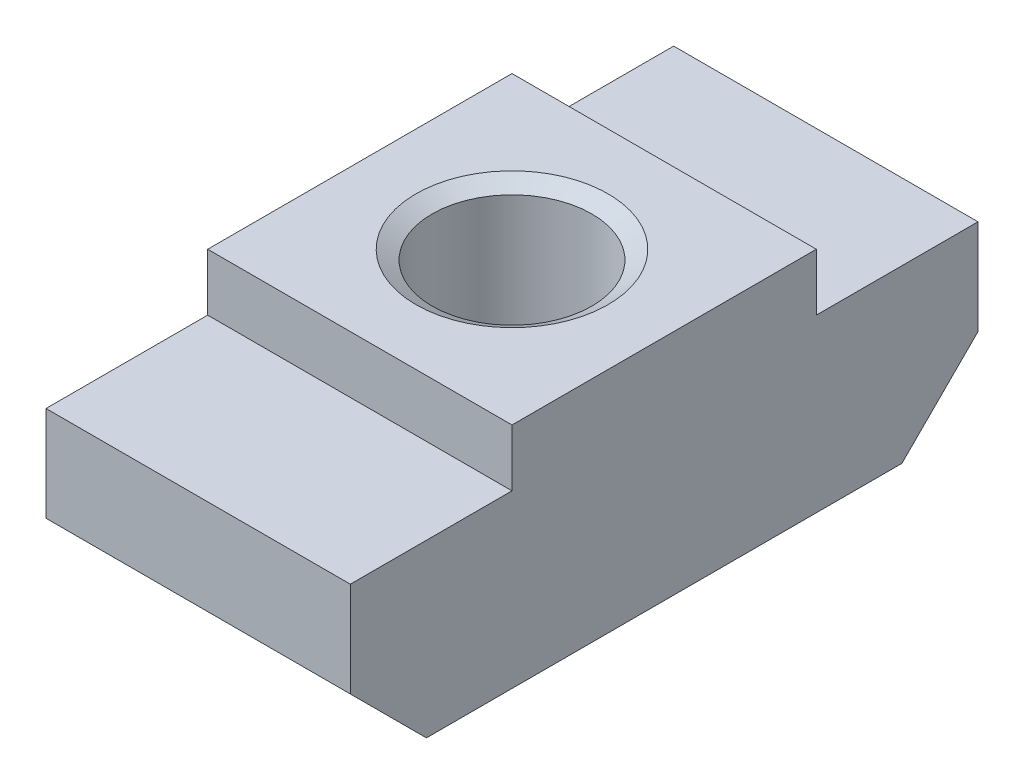
ISO-10303-21;
HEADER;
FILE_DESCRIPTION(('STEP AP214'),'2;1');
FILE_NAME('part.step','',(''),(''),'','','');
FILE_SCHEMA(('AUTOMOTIVE_DESIGN { 1 0 10303 214 1 1 1 1 }'));
ENDSEC;
DATA;
#1=APPLICATION_CONTEXT('core data for automotive mechanical design processes');
#2=APPLICATION_PROTOCOL_DEFINITION('international standard','automotive_design',2000,#1);
#3=PRODUCT_CONTEXT('',#1,'mechanical');
#4=PRODUCT('Part','Part','',(#3));
#5=PRODUCT_RELATED_PRODUCT_CATEGORY('part','',(#4));
#6=PRODUCT_DEFINITION_FORMATION('','',#4);
#7=PRODUCT_DEFINITION_CONTEXT('part definition',#1,'design');
#8=PRODUCT_DEFINITION('design','',#6,#7);
#9=PRODUCT_DEFINITION_SHAPE('','',#8);
#10=(LENGTH_UNIT() NAMED_UNIT(*) SI_UNIT(.MILLI.,.METRE.));
#11=(NAMED_UNIT(*) PLANE_ANGLE_UNIT() SI_UNIT($,.RADIAN.));
#12=(NAMED_UNIT(*) SI_UNIT($,.STERADIAN.) SOLID_ANGLE_UNIT());
#13=UNCERTAINTY_MEASURE_WITH_UNIT(LENGTH_MEASURE(1.E-05),#10,'distance_accuracy_value','');
#14=(GEOMETRIC_REPRESENTATION_CONTEXT(3) GLOBAL_UNCERTAINTY_ASSIGNED_CONTEXT((#13)) GLOBAL_UNIT_ASSIGNED_CONTEXT((#10,
#11,#12)) REPRESENTATION_CONTEXT('',''));
#15=CARTESIAN_POINT('',(0.,0.,0.));
#16=DIRECTION('',(0.,0.,1.));
#17=DIRECTION('',(1.,0.,0.));
#18=AXIS2_PLACEMENT_3D('',#15,#16,#17);
#19=CARTESIAN_POINT('',(-4.,6.,16.5));
#20=DIRECTION('',(1.,0.,0.));
#21=DIRECTION('',(0.,0.,-1.));
#22=AXIS2_PLACEMENT_3D('',#19,#20,#21);
#23=PLANE('',#22);
#24=DIRECTION('',(0.,0.,-1.));
#25=VECTOR('',#24,1.);
#26=CARTESIAN_POINT('',(-4.,4.5,16.5));
#27=LINE('',#26,#25);
#28=CARTESIAN_POINT('',(-4.,4.5,16.5));
#29=VERTEX_POINT('',#28);
#30=CARTESIAN_POINT('',(-4.,4.5,12.25));
#31=VERTEX_POINT('',#30);
#32=EDGE_CURVE('E49',#29,#31,#27,.T.);
#33=ORIENTED_EDGE('',*,*,#32,.T.);
#34=DIRECTION('',(0.,1.,0.));
#35=VECTOR('',#34,1.);
#36=CARTESIAN_POINT('',(-4.,6.,12.25));
#37=LINE('',#36,#35);
#38=CARTESIAN_POINT('',(-4.,6.,12.25));
#39=VERTEX_POINT('',#38);
#40=EDGE_CURVE('E220',#31,#39,#37,.T.);
#41=ORIENTED_EDGE('',*,*,#40,.T.);
#42=DIRECTION('',(0.,0.,-1.));
#43=VECTOR('',#42,1.);
#44=CARTESIAN_POINT('',(-4.,6.,16.5));
#45=LINE('',#44,#43);
#46=CARTESIAN_POINT('',(-4.,6.,4.25));
#47=VERTEX_POINT('',#46);
#48=EDGE_CURVE('E129',#39,#47,#45,.T.);
#49=ORIENTED_EDGE('',*,*,#48,.T.);
#50=DIRECTION('',(0.,-1.,0.));
#51=VECTOR('',#50,1.);
#52=CARTESIAN_POINT('',(-4.,6.,4.25));
#53=LINE('',#52,#51);
#54=CARTESIAN_POINT('',(-4.,4.5,4.25));
#55=VERTEX_POINT('',#54);
#56=EDGE_CURVE('E165',#47,#55,#53,.T.);
#57=ORIENTED_EDGE('',*,*,#56,.T.);
#58=DIRECTION('',(0.,0.,-1.));
#59=VECTOR('',#58,1.);
#60=CARTESIAN_POINT('',(-4.,4.5,16.5));
#61=LINE('',#60,#59);
#62=CARTESIAN_POINT('',(-4.,4.5,0.));
#63=VERTEX_POINT('',#62);
#64=EDGE_CURVE('E170',#55,#63,#61,.T.);
#65=ORIENTED_EDGE('',*,*,#64,.T.);
#66=DIRECTION('',(0.,-1.,0.));
#67=VECTOR('',#66,1.);
#68=CARTESIAN_POINT('',(-4.,6.,0.));
#69=LINE('',#68,#67);
#70=CARTESIAN_POINT('',(-4.,2.,0.));
#71=VERTEX_POINT('',#70);
#72=EDGE_CURVE('E138',#63,#71,#69,.T.);
#73=ORIENTED_EDGE('',*,*,#72,.T.);
#74=DIRECTION('',(0.,-0.707106781186548,0.707106781186548));
#75=VECTOR('',#74,1.);
#76=CARTESIAN_POINT('',(-4.,-4.25,6.25));
#77=LINE('',#76,#75);
#78=CARTESIAN_POINT('',(-4.,0.,2.));
#79=VERTEX_POINT('',#78);
#80=EDGE_CURVE('E167',#71,#79,#77,.T.);
#81=ORIENTED_EDGE('',*,*,#80,.T.);
#82=DIRECTION('',(0.,0.,-1.));
#83=VECTOR('',#82,1.);
#84=CARTESIAN_POINT('',(-4.,0.,16.5));
#85=LINE('',#84,#83);
#86=CARTESIAN_POINT('',(-4.,0.,14.5));
#87=VERTEX_POINT('',#86);
#88=EDGE_CURVE('E147',#87,#79,#85,.T.);
#89=ORIENTED_EDGE('',*,*,#88,.F.);
#90=DIRECTION('',(0.,0.707106781186547,0.707106781186548));
#91=VECTOR('',#90,1.);
#92=CARTESIAN_POINT('',(-4.,4.,18.5));
#93=LINE('',#92,#91);
#94=CARTESIAN_POINT('',(-4.,2.,16.5));
#95=VERTEX_POINT('',#94);
#96=EDGE_CURVE('E180',#87,#95,#93,.T.);
#97=ORIENTED_EDGE('',*,*,#96,.T.);
#98=DIRECTION('',(0.,-1.,0.));
#99=VECTOR('',#98,1.);
#100=CARTESIAN_POINT('',(-4.,6.,16.5));
#101=LINE('',#100,#99);
#102=EDGE_CURVE('E130',#29,#95,#101,.T.);
#103=ORIENTED_EDGE('',*,*,#102,.F.);
#104=EDGE_LOOP('',(#33,#41,#49,#57,#65,#73,#81,#89,#97,#103));
#105=FACE_BOUND('',#104,.T.);
#106=ADVANCED_FACE('F36',(#105),#23,.F.);
#107=CARTESIAN_POINT('',(-4.,0.,16.5));
#108=DIRECTION('',(0.,1.,0.));
#109=DIRECTION('',(0.,0.,1.));
#110=AXIS2_PLACEMENT_3D('',#107,#108,#109);
#111=PLANE('',#110);
#112=CARTESIAN_POINT('',(0.,0.,8.25));
#113=DIRECTION('',(0.,1.,0.));
#114=DIRECTION('',(0.,0.,1.));
#115=AXIS2_PLACEMENT_3D('',#112,#113,#114);
#116=CIRCLE('',#115,2.1);
#117=CARTESIAN_POINT('',(0.,0.,10.35));
#118=VERTEX_POINT('',#117);
#119=EDGE_CURVE('E140',#118,#118,#116,.T.);
#120=ORIENTED_EDGE('',*,*,#119,.T.);
#121=EDGE_LOOP('',(#120));
#122=FACE_BOUND('',#121,.T.);
#123=ORIENTED_EDGE('',*,*,#88,.T.);
#124=DIRECTION('',(1.,0.,0.));
#125=VECTOR('',#124,1.);
#126=CARTESIAN_POINT('',(-6.,0.,2.));
#127=LINE('',#126,#125);
#128=CARTESIAN_POINT('',(4.,0.,2.));
#129=VERTEX_POINT('',#128);
#130=EDGE_CURVE('E164',#79,#129,#127,.T.);
#131=ORIENTED_EDGE('',*,*,#130,.T.);
#132=DIRECTION('',(0.,0.,-1.));
#133=VECTOR('',#132,1.);
#134=CARTESIAN_POINT('',(4.,0.,16.5));
#135=LINE('',#134,#133);
#136=CARTESIAN_POINT('',(4.,0.,14.5));
#137=VERTEX_POINT('',#136);
#138=EDGE_CURVE('E144',#137,#129,#135,.T.);
#139=ORIENTED_EDGE('',*,*,#138,.F.);
#140=DIRECTION('',(1.,0.,0.));
#141=VECTOR('',#140,1.);
#142=CARTESIAN_POINT('',(-6.,0.,14.5));
#143=LINE('',#142,#141);
#144=EDGE_CURVE('E178',#87,#137,#143,.T.);
#145=ORIENTED_EDGE('',*,*,#144,.F.);
#146=EDGE_LOOP('',(#123,#131,#139,#145));
#147=FACE_BOUND('',#146,.T.);
#148=ADVANCED_FACE('F191',(#122,#147),#111,.F.);
#149=CARTESIAN_POINT('',(4.,6.,16.5));
#150=DIRECTION('',(-1.,0.,0.));
#151=DIRECTION('',(0.,0.,1.));
#152=AXIS2_PLACEMENT_3D('',#149,#150,#151);
#153=PLANE('',#152);
#154=DIRECTION('',(0.,0.,-1.));
#155=VECTOR('',#154,1.);
#156=CARTESIAN_POINT('',(4.,6.,16.5));
#157=LINE('',#156,#155);
#158=CARTESIAN_POINT('',(4.,6.,12.25));
#159=VERTEX_POINT('',#158);
#160=CARTESIAN_POINT('',(4.,6.,4.25));
#161=VERTEX_POINT('',#160);
#162=EDGE_CURVE('E132',#159,#161,#157,.T.);
#163=ORIENTED_EDGE('',*,*,#162,.F.);
#164=DIRECTION('',(0.,1.,0.));
#165=VECTOR('',#164,1.);
#166=CARTESIAN_POINT('',(4.,4.5,12.25));
#167=LINE('',#166,#165);
#168=CARTESIAN_POINT('',(4.,4.5,12.25));
#169=VERTEX_POINT('',#168);
#170=EDGE_CURVE('E123',#169,#159,#167,.T.);
#171=ORIENTED_EDGE('',*,*,#170,.F.);
#172=DIRECTION('',(0.,0.,-1.));
#173=VECTOR('',#172,1.);
#174=CARTESIAN_POINT('',(4.,4.5,16.5));
#175=LINE('',#174,#173);
#176=CARTESIAN_POINT('',(4.,4.5,16.5));
#177=VERTEX_POINT('',#176);
#178=EDGE_CURVE('E112',#177,#169,#175,.T.);
#179=ORIENTED_EDGE('',*,*,#178,.F.);
#180=DIRECTION('',(0.,1.,0.));
#181=VECTOR('',#180,1.);
#182=CARTESIAN_POINT('',(4.,6.,16.5));
#183=LINE('',#182,#181);
#184=CARTESIAN_POINT('',(4.,2.,16.5));
#185=VERTEX_POINT('',#184);
#186=EDGE_CURVE('E122',#185,#177,#183,.T.);
#187=ORIENTED_EDGE('',*,*,#186,.F.);
#188=DIRECTION('',(0.,0.707106781186547,0.707106781186548));
#189=VECTOR('',#188,1.);
#190=CARTESIAN_POINT('',(4.,2.,16.5));
#191=LINE('',#190,#189);
#192=EDGE_CURVE('E176',#137,#185,#191,.T.);
#193=ORIENTED_EDGE('',*,*,#192,.F.);
#194=ORIENTED_EDGE('',*,*,#138,.T.);
#195=DIRECTION('',(0.,-0.707106781186548,0.707106781186548));
#196=VECTOR('',#195,1.);
#197=CARTESIAN_POINT('',(4.,2.,0.));
#198=LINE('',#197,#196);
#199=CARTESIAN_POINT('',(4.,2.,0.));
#200=VERTEX_POINT('',#199);
#201=EDGE_CURVE('E160',#200,#129,#198,.T.);
#202=ORIENTED_EDGE('',*,*,#201,.F.);
#203=DIRECTION('',(0.,1.,0.));
#204=VECTOR('',#203,1.);
#205=CARTESIAN_POINT('',(4.,6.,0.));
#206=LINE('',#205,#204);
#207=CARTESIAN_POINT('',(4.,4.5,0.));
#208=VERTEX_POINT('',#207);
#209=EDGE_CURVE('E134',#200,#208,#206,.T.);
#210=ORIENTED_EDGE('',*,*,#209,.T.);
#211=DIRECTION('',(0.,0.,-1.));
#212=VECTOR('',#211,1.);
#213=CARTESIAN_POINT('',(4.,4.5,0.));
#214=LINE('',#213,#212);
#215=CARTESIAN_POINT('',(4.,4.5,4.25));
#216=VERTEX_POINT('',#215);
#217=EDGE_CURVE('E57',#216,#208,#214,.T.);
#218=ORIENTED_EDGE('',*,*,#217,.F.);
#219=DIRECTION('',(0.,-1.,0.));
#220=VECTOR('',#219,1.);
#221=CARTESIAN_POINT('',(4.,4.5,4.25));
#222=LINE('',#221,#220);
#223=EDGE_CURVE('E226',#161,#216,#222,.T.);
#224=ORIENTED_EDGE('',*,*,#223,.F.);
#225=EDGE_LOOP('',(#163,#171,#179,#187,#193,#194,#202,#210,#218,#224));
#226=FACE_BOUND('',#225,.T.);
#227=ADVANCED_FACE('F120',(#226),#153,.F.);
#228=CARTESIAN_POINT('',(-4.,6.,16.5));
#229=DIRECTION('',(0.,-1.,0.));
#230=DIRECTION('',(0.,0.,-1.));
#231=AXIS2_PLACEMENT_3D('',#228,#229,#230);
#232=PLANE('',#231);
#233=CARTESIAN_POINT('',(0.,6.,8.25));
#234=DIRECTION('',(0.,1.,0.));
#235=DIRECTION('',(0.,0.,1.));
#236=AXIS2_PLACEMENT_3D('',#233,#234,#235);
#237=CIRCLE('',#236,2.525);
#238=CARTESIAN_POINT('',(0.,6.,10.775));
#239=VERTEX_POINT('',#238);
#240=EDGE_CURVE('E183',#239,#239,#237,.T.);
#241=ORIENTED_EDGE('',*,*,#240,.F.);
#242=EDGE_LOOP('',(#241));
#243=FACE_BOUND('',#242,.T.);
#244=ORIENTED_EDGE('',*,*,#48,.F.);
#245=DIRECTION('',(1.,0.,0.));
#246=VECTOR('',#245,1.);
#247=CARTESIAN_POINT('',(-6.,6.,12.25));
#248=LINE('',#247,#246);
#249=EDGE_CURVE('E214',#39,#159,#248,.T.);
#250=ORIENTED_EDGE('',*,*,#249,.T.);
#251=ORIENTED_EDGE('',*,*,#162,.T.);
#252=DIRECTION('',(1.,0.,0.));
#253=VECTOR('',#252,1.);
#254=CARTESIAN_POINT('',(-6.,6.,4.25));
#255=LINE('',#254,#253);
#256=EDGE_CURVE('E216',#47,#161,#255,.T.);
#257=ORIENTED_EDGE('',*,*,#256,.F.);
#258=EDGE_LOOP('',(#244,#250,#251,#257));
#259=FACE_BOUND('',#258,.T.);
#260=ADVANCED_FACE('F207',(#243,#259),#232,.F.);
#261=CARTESIAN_POINT('',(0.,0.,16.5));
#262=DIRECTION('',(0.,0.,1.));
#263=DIRECTION('',(1.,0.,0.));
#264=AXIS2_PLACEMENT_3D('',#261,#262,#263);
#265=PLANE('',#264);
#266=DIRECTION('',(1.,0.,0.));
#267=VECTOR('',#266,1.);
#268=CARTESIAN_POINT('',(0.,4.5,16.5));
#269=LINE('',#268,#267);
#270=EDGE_CURVE('E11',#29,#177,#269,.T.);
#271=ORIENTED_EDGE('',*,*,#270,.F.);
#272=ORIENTED_EDGE('',*,*,#102,.T.);
#273=DIRECTION('',(-1.,0.,0.));
#274=VECTOR('',#273,1.);
#275=CARTESIAN_POINT('',(0.,2.,16.5));
#276=LINE('',#275,#274);
#277=EDGE_CURVE('E128',#185,#95,#276,.T.);
#278=ORIENTED_EDGE('',*,*,#277,.F.);
#279=ORIENTED_EDGE('',*,*,#186,.T.);
#280=EDGE_LOOP('',(#271,#272,#278,#279));
#281=FACE_BOUND('',#280,.T.);
#282=ADVANCED_FACE('F126',(#281),#265,.T.);
#283=CARTESIAN_POINT('',(0.,0.,0.));
#284=DIRECTION('',(0.,0.,1.));
#285=DIRECTION('',(1.,0.,0.));
#286=AXIS2_PLACEMENT_3D('',#283,#284,#285);
#287=PLANE('',#286);
#288=ORIENTED_EDGE('',*,*,#72,.F.);
#289=DIRECTION('',(1.,0.,0.));
#290=VECTOR('',#289,1.);
#291=CARTESIAN_POINT('',(0.,4.5,0.));
#292=LINE('',#291,#290);
#293=EDGE_CURVE('E43',#63,#208,#292,.T.);
#294=ORIENTED_EDGE('',*,*,#293,.T.);
#295=ORIENTED_EDGE('',*,*,#209,.F.);
#296=DIRECTION('',(-1.,0.,0.));
#297=VECTOR('',#296,1.);
#298=CARTESIAN_POINT('',(0.,2.,0.));
#299=LINE('',#298,#297);
#300=EDGE_CURVE('E151',#200,#71,#299,.T.);
#301=ORIENTED_EDGE('',*,*,#300,.T.);
#302=EDGE_LOOP('',(#288,#294,#295,#301));
#303=FACE_BOUND('',#302,.T.);
#304=ADVANCED_FACE('F156',(#303),#287,.F.);
#305=CARTESIAN_POINT('',(0.,6.,8.25));
#306=DIRECTION('',(0.,1.,0.));
#307=DIRECTION('',(0.,0.,1.));
#308=AXIS2_PLACEMENT_3D('',#305,#306,#307);
#309=CYLINDRICAL_SURFACE('',#308,2.1);
#310=ORIENTED_EDGE('',*,*,#119,.F.);
#311=EDGE_LOOP('',(#310));
#312=FACE_BOUND('',#311,.T.);
#313=CARTESIAN_POINT('',(0.,5.75462613559441,8.25));
#314=DIRECTION('',(0.,1.,0.));
#315=DIRECTION('',(0.,0.,1.));
#316=AXIS2_PLACEMENT_3D('',#313,#314,#315);
#317=CIRCLE('',#316,2.1);
#318=CARTESIAN_POINT('',(0.,5.75462613559441,10.35));
#319=VERTEX_POINT('',#318);
#320=EDGE_CURVE('E186',#319,#319,#317,.T.);
#321=ORIENTED_EDGE('',*,*,#320,.T.);
#322=EDGE_LOOP('',(#321));
#323=FACE_BOUND('',#322,.T.);
#324=ADVANCED_FACE('F194',(#312,#323),#309,.F.);
#325=CARTESIAN_POINT('',(0.,6.,8.25));
#326=DIRECTION('',(0.,1.,0.));
#327=DIRECTION('',(0.,0.,1.));
#328=AXIS2_PLACEMENT_3D('',#325,#326,#327);
#329=CONICAL_SURFACE('',#328,2.525,1.0471975511966);
#330=ORIENTED_EDGE('',*,*,#320,.F.);
#331=EDGE_LOOP('',(#330));
#332=FACE_BOUND('',#331,.T.);
#333=ORIENTED_EDGE('',*,*,#240,.T.);
#334=EDGE_LOOP('',(#333));
#335=FACE_BOUND('',#334,.T.);
#336=ADVANCED_FACE('F197',(#332,#335),#329,.F.);
#337=CARTESIAN_POINT('',(-6.,2.,16.5));
#338=DIRECTION('',(0.,0.707106781186548,-0.707106781186547));
#339=DIRECTION('',(0.,0.707106781186547,0.707106781186548));
#340=AXIS2_PLACEMENT_3D('',#337,#338,#339);
#341=PLANE('',#340);
#342=ORIENTED_EDGE('',*,*,#144,.T.);
#343=ORIENTED_EDGE('',*,*,#192,.T.);
#344=ORIENTED_EDGE('',*,*,#277,.T.);
#345=ORIENTED_EDGE('',*,*,#96,.F.);
#346=EDGE_LOOP('',(#342,#343,#344,#345));
#347=FACE_BOUND('',#346,.T.);
#348=ADVANCED_FACE('F203',(#347),#341,.F.);
#349=CARTESIAN_POINT('',(-6.,2.,0.));
#350=DIRECTION('',(0.,0.707106781186548,0.707106781186548));
#351=DIRECTION('',(0.,-0.707106781186548,0.707106781186548));
#352=AXIS2_PLACEMENT_3D('',#349,#350,#351);
#353=PLANE('',#352);
#354=ORIENTED_EDGE('',*,*,#300,.F.);
#355=ORIENTED_EDGE('',*,*,#201,.T.);
#356=ORIENTED_EDGE('',*,*,#130,.F.);
#357=ORIENTED_EDGE('',*,*,#80,.F.);
#358=EDGE_LOOP('',(#354,#355,#356,#357));
#359=FACE_BOUND('',#358,.T.);
#360=ADVANCED_FACE('F243',(#359),#353,.F.);
#361=CARTESIAN_POINT('',(-6.,4.5,4.25));
#362=DIRECTION('',(0.,0.,1.));
#363=DIRECTION('',(1.,0.,0.));
#364=AXIS2_PLACEMENT_3D('',#361,#362,#363);
#365=PLANE('',#364);
#366=ORIENTED_EDGE('',*,*,#256,.T.);
#367=ORIENTED_EDGE('',*,*,#223,.T.);
#368=DIRECTION('',(1.,0.,0.));
#369=VECTOR('',#368,1.);
#370=CARTESIAN_POINT('',(-6.,4.5,4.25));
#371=LINE('',#370,#369);
#372=EDGE_CURVE('E225',#55,#216,#371,.T.);
#373=ORIENTED_EDGE('',*,*,#372,.F.);
#374=ORIENTED_EDGE('',*,*,#56,.F.);
#375=EDGE_LOOP('',(#366,#367,#373,#374));
#376=FACE_BOUND('',#375,.T.);
#377=ADVANCED_FACE('F223',(#376),#365,.F.);
#378=CARTESIAN_POINT('',(-6.,4.5,0.));
#379=DIRECTION('',(0.,-1.,0.));
#380=DIRECTION('',(0.,0.,-1.));
#381=AXIS2_PLACEMENT_3D('',#378,#379,#380);
#382=PLANE('',#381);
#383=ORIENTED_EDGE('',*,*,#372,.T.);
#384=ORIENTED_EDGE('',*,*,#217,.T.);
#385=ORIENTED_EDGE('',*,*,#293,.F.);
#386=ORIENTED_EDGE('',*,*,#64,.F.);
#387=EDGE_LOOP('',(#383,#384,#385,#386));
#388=FACE_BOUND('',#387,.T.);
#389=ADVANCED_FACE('F244',(#388),#382,.F.);
#390=CARTESIAN_POINT('',(-6.,4.5,12.25));
#391=DIRECTION('',(0.,0.,-1.));
#392=DIRECTION('',(-1.,0.,0.));
#393=AXIS2_PLACEMENT_3D('',#390,#391,#392);
#394=PLANE('',#393);
#395=DIRECTION('',(1.,0.,0.));
#396=VECTOR('',#395,1.);
#397=CARTESIAN_POINT('',(-6.,4.5,12.25));
#398=LINE('',#397,#396);
#399=EDGE_CURVE('E234',#31,#169,#398,.T.);
#400=ORIENTED_EDGE('',*,*,#399,.T.);
#401=ORIENTED_EDGE('',*,*,#170,.T.);
#402=ORIENTED_EDGE('',*,*,#249,.F.);
#403=ORIENTED_EDGE('',*,*,#40,.F.);
#404=EDGE_LOOP('',(#400,#401,#402,#403));
#405=FACE_BOUND('',#404,.T.);
#406=ADVANCED_FACE('F238',(#405),#394,.F.);
#407=CARTESIAN_POINT('',(-6.,4.5,16.5));
#408=DIRECTION('',(0.,-1.,0.));
#409=DIRECTION('',(0.,0.,-1.));
#410=AXIS2_PLACEMENT_3D('',#407,#408,#409);
#411=PLANE('',#410);
#412=ORIENTED_EDGE('',*,*,#270,.T.);
#413=ORIENTED_EDGE('',*,*,#178,.T.);
#414=ORIENTED_EDGE('',*,*,#399,.F.);
#415=ORIENTED_EDGE('',*,*,#32,.F.);
#416=EDGE_LOOP('',(#412,#413,#414,#415));
#417=FACE_BOUND('',#416,.T.);
#418=ADVANCED_FACE('F111',(#417),#411,.F.);
#419=CLOSED_SHELL('',(#106,#148,#227,#260,#282,#304,#324,#336,#348,#360,#377,#389,#406,#418));
#420=MANIFOLD_SOLID_BREP('B2',#419);
#421=ADVANCED_BREP_SHAPE_REPRESENTATION('',(#18,#420),#14);
#422=SHAPE_DEFINITION_REPRESENTATION(#9,#421);
ENDSEC;
END-ISO-10303-21;
